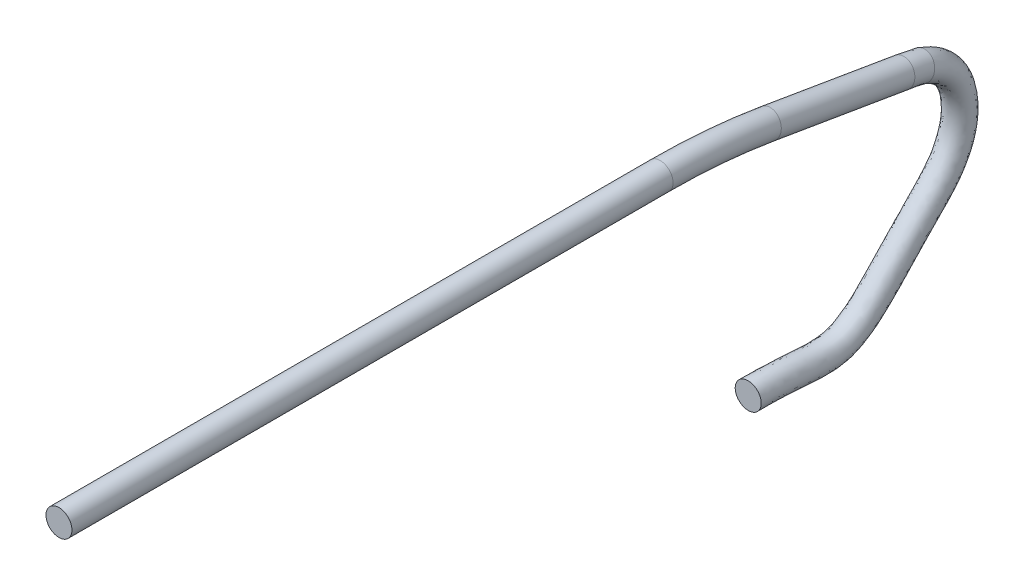
ISO-10303-21;
HEADER;
FILE_DESCRIPTION(('STEP AP214'),'2;1');
FILE_NAME('part.step','',(''),(''),'','','');
FILE_SCHEMA(('AUTOMOTIVE_DESIGN { 1 0 10303 214 1 1 1 1 }'));
ENDSEC;
DATA;
#1=APPLICATION_CONTEXT('core data for automotive mechanical design processes');
#2=APPLICATION_PROTOCOL_DEFINITION('international standard','automotive_design',2000,#1);
#3=PRODUCT_CONTEXT('',#1,'mechanical');
#4=PRODUCT('Part','Part','',(#3));
#5=PRODUCT_RELATED_PRODUCT_CATEGORY('part','',(#4));
#6=PRODUCT_DEFINITION_FORMATION('','',#4);
#7=PRODUCT_DEFINITION_CONTEXT('part definition',#1,'design');
#8=PRODUCT_DEFINITION('design','',#6,#7);
#9=PRODUCT_DEFINITION_SHAPE('','',#8);
#10=(LENGTH_UNIT() NAMED_UNIT(*) SI_UNIT(.MILLI.,.METRE.));
#11=(NAMED_UNIT(*) PLANE_ANGLE_UNIT() SI_UNIT($,.RADIAN.));
#12=(NAMED_UNIT(*) SI_UNIT($,.STERADIAN.) SOLID_ANGLE_UNIT());
#13=UNCERTAINTY_MEASURE_WITH_UNIT(LENGTH_MEASURE(1.E-05),#10,'distance_accuracy_value','');
#14=(GEOMETRIC_REPRESENTATION_CONTEXT(3) GLOBAL_UNCERTAINTY_ASSIGNED_CONTEXT((#13)) GLOBAL_UNIT_ASSIGNED_CONTEXT((#10,
#11,#12)) REPRESENTATION_CONTEXT('',''));
#15=CARTESIAN_POINT('',(0.,0.,0.));
#16=DIRECTION('',(0.,0.,1.));
#17=DIRECTION('',(1.,0.,0.));
#18=AXIS2_PLACEMENT_3D('',#15,#16,#17);
#19=CARTESIAN_POINT('',(0.,18.1941475642454,2.71925482497201));
#20=DIRECTION('',(0.,-0.166183327058587,-0.986094874648347));
#21=DIRECTION('',(0.,0.986094874648347,-0.166183327058587));
#22=AXIS2_PLACEMENT_3D('',#19,#20,#21);
#23=CYLINDRICAL_SURFACE('',#22,1.);
#24=CARTESIAN_POINT('',(0.,18.1941475642454,2.71925482497201));
#25=DIRECTION('',(0.,0.166183327058594,0.986094874648346));
#26=DIRECTION('',(1.,0.,0.));
#27=AXIS2_PLACEMENT_3D('',#24,#25,#26);
#28=CIRCLE('',#27,1.);
#29=CARTESIAN_POINT('',(0.,19.1802424388938,2.55307149791342));
#30=VERTEX_POINT('',#29);
#31=EDGE_CURVE('E10',#30,#30,#28,.T.);
#32=ORIENTED_EDGE('',*,*,#31,.F.);
#33=EDGE_LOOP('',(#32));
#34=FACE_BOUND('',#33,.T.);
#35=CARTESIAN_POINT('',(0.,16.4622432885766,-7.55747966967757));
#36=DIRECTION('',(0.,0.166183327058594,0.986094874648346));
#37=DIRECTION('',(1.,0.,0.));
#38=AXIS2_PLACEMENT_3D('',#35,#36,#37);
#39=CIRCLE('',#38,1.);
#40=CARTESIAN_POINT('',(1.,16.4622432885766,-7.55747966967757));
#41=VERTEX_POINT('',#40);
#42=EDGE_CURVE('E45',#41,#41,#39,.T.);
#43=ORIENTED_EDGE('',*,*,#42,.T.);
#44=EDGE_LOOP('',(#43));
#45=FACE_BOUND('',#44,.T.);
#46=ADVANCED_FACE('F30',(#34,#45),#23,.T.);
#47=CARTESIAN_POINT('',(0.,-31.1105961681719,11.0284211779015));
#48=DIRECTION('',(-1.,0.,0.));
#49=DIRECTION('',(0.,0.,1.));
#50=AXIS2_PLACEMENT_3D('',#47,#48,#49);
#51=TOROIDAL_SURFACE('',#50,50.,1.);
#52=CARTESIAN_POINT('',(0.,18.8894038318281,11.0284211779017));
#53=DIRECTION('',(0.,0.,1.));
#54=DIRECTION('',(1.,0.,0.));
#55=AXIS2_PLACEMENT_3D('',#52,#53,#54);
#56=CIRCLE('',#55,1.);
#57=CARTESIAN_POINT('',(0.,19.8894038318281,11.0284211779017));
#58=VERTEX_POINT('',#57);
#59=EDGE_CURVE('E36',#58,#58,#56,.T.);
#60=CARTESIAN_POINT('',(0.,-31.1105961681719,11.0284211779015));
#61=DIRECTION('',(-1.,0.,0.));
#62=DIRECTION('',(0.,0.,1.));
#63=AXIS2_PLACEMENT_3D('',#60,#61,#62);
#64=CIRCLE('',#63,51.);
#65=EDGE_CURVE('',#58,#30,#64,.T.);
#66=ORIENTED_EDGE('',*,*,#59,.F.);
#67=ORIENTED_EDGE('',*,*,#31,.T.);
#68=ORIENTED_EDGE('',*,*,#65,.T.);
#69=ORIENTED_EDGE('',*,*,#65,.F.);
#70=EDGE_LOOP('',(#66,#68,#67,#69));
#71=FACE_BOUND('',#70,.T.);
#72=ADVANCED_FACE('F77',(#71),#51,.T.);
#73=CARTESIAN_POINT('',(0.,18.8894038318281,11.0284211779017));
#74=DIRECTION('',(0.,0.,1.));
#75=DIRECTION('',(1.,0.,0.));
#76=AXIS2_PLACEMENT_3D('',#73,#74,#75);
#77=CYLINDRICAL_SURFACE('',#76,1.);
#78=ORIENTED_EDGE('',*,*,#59,.T.);
#79=EDGE_LOOP('',(#78));
#80=FACE_BOUND('',#79,.T.);
#81=CARTESIAN_POINT('',(0.,18.8894038318281,57.2770295781031));
#82=DIRECTION('',(0.,0.,1.));
#83=DIRECTION('',(1.,0.,0.));
#84=AXIS2_PLACEMENT_3D('',#81,#82,#83);
#85=CIRCLE('',#84,1.);
#86=CARTESIAN_POINT('',(1.,18.8894038318281,57.2770295781031));
#87=VERTEX_POINT('',#86);
#88=EDGE_CURVE('E40',#87,#87,#85,.T.);
#89=ORIENTED_EDGE('',*,*,#88,.F.);
#90=EDGE_LOOP('',(#89));
#91=FACE_BOUND('',#90,.T.);
#92=ADVANCED_FACE('F82',(#80,#91),#77,.T.);
#93=CARTESIAN_POINT('',(0.,18.8894038318281,57.2770295781031));
#94=DIRECTION('',(0.,0.,1.));
#95=DIRECTION('',(1.,0.,0.));
#96=AXIS2_PLACEMENT_3D('',#93,#94,#95);
#97=PLANE('',#96);
#98=ORIENTED_EDGE('',*,*,#88,.T.);
#99=EDGE_LOOP('',(#98));
#100=FACE_BOUND('',#99,.T.);
#101=ADVANCED_FACE('F73',(#100),#97,.T.);
#102=CARTESIAN_POINT('',(1.,16.4622432885766,-7.55747966967757));
#103=CARTESIAN_POINT('',(1.,16.4148155317037,-7.83890542276721));
#104=CARTESIAN_POINT('',(1.,16.3213205135418,-8.34014082138923));
#105=CARTESIAN_POINT('',(1.,16.2122653735762,-8.83815849860704));
#106=CARTESIAN_POINT('',(1.,16.1612796956823,-9.05664870644192));
#107=CARTESIAN_POINT('',(1.,18.4344330378733,-7.88984632379476));
#108=CARTESIAN_POINT('',(1.,18.3870052810004,-8.1712720768844));
#109=CARTESIAN_POINT('',(1.,18.2768862191973,-8.77382697706672));
#110=CARTESIAN_POINT('',(1.,18.1357637519508,-9.39625421122117));
#111=CARTESIAN_POINT('',(1.,18.084778074057,-9.61474441905606));
#112=CARTESIAN_POINT('',(-1.,18.4344330378733,-7.88984632379476));
#113=CARTESIAN_POINT('',(-1.,18.3870052810004,-8.1712720768844));
#114=CARTESIAN_POINT('',(-1.,18.2768862191973,-8.77382697706672));
#115=CARTESIAN_POINT('',(-1.,18.1357637519508,-9.39625421122117));
#116=CARTESIAN_POINT('',(-1.,18.084778074057,-9.61474441905606));
#117=CARTESIAN_POINT('',(-1.,16.4622432885766,-7.55747966967757));
#118=CARTESIAN_POINT('',(-1.,16.4148155317037,-7.83890542276721));
#119=CARTESIAN_POINT('',(-1.,16.3213205135418,-8.34014082138923));
#120=CARTESIAN_POINT('',(-1.,16.2122653735762,-8.83815849860704));
#121=CARTESIAN_POINT('',(-1.,16.1612796956823,-9.05664870644192));
#122=CARTESIAN_POINT('',(-1.,14.4900535392799,-7.22511301556038));
#123=CARTESIAN_POINT('',(-1.,14.442625782407,-7.50653876865002));
#124=CARTESIAN_POINT('',(-1.,14.3657548078863,-7.90645466571175));
#125=CARTESIAN_POINT('',(-1.,14.2887669952015,-8.2800627859929));
#126=CARTESIAN_POINT('',(-1.,14.2377813173077,-8.49855299382779));
#127=CARTESIAN_POINT('',(1.,14.4900535392799,-7.22511301556038));
#128=CARTESIAN_POINT('',(1.,14.442625782407,-7.50653876865002));
#129=CARTESIAN_POINT('',(1.,14.3657548078863,-7.90645466571175));
#130=CARTESIAN_POINT('',(1.,14.2887669952015,-8.2800627859929));
#131=CARTESIAN_POINT('',(1.,14.2377813173077,-8.49855299382779));
#132=CARTESIAN_POINT('',(1.,16.4622432885766,-7.55747966967757));
#133=CARTESIAN_POINT('',(1.,16.4148155317037,-7.83890542276721));
#134=CARTESIAN_POINT('',(1.,16.3213205135418,-8.34014082138923));
#135=CARTESIAN_POINT('',(1.,16.2122653735762,-8.83815849860704));
#136=CARTESIAN_POINT('',(1.,16.1612796956823,-9.05664870644192));
#137=(BOUNDED_SURFACE() B_SPLINE_SURFACE(3,3,((#102,#103,#104,#105,#106),(#107,#108,#109,#110,
#111),(#112,#113,#114,#115,#116),(#117,#118,#119,#120,#121),(#122,#123,#124,#125,#126),(#127,
#128,#129,#130,#131),(#132,#133,#134,#135,#136)),.UNSPECIFIED.,.T.,.F.,
.F.) B_SPLINE_SURFACE_WITH_KNOTS((4,3,4),(4,1,4),(0.,0.5,1.),(0.,0.559865376858509,1.),
.UNSPECIFIED.) GEOMETRIC_REPRESENTATION_ITEM() RATIONAL_B_SPLINE_SURFACE(((1.,1.,1.,1.,1.),
(0.333333333333333,0.333333333333333,0.333333333333333,0.333333333333333,0.333333333333333),
(0.333333333333333,0.333333333333333,0.333333333333333,0.333333333333333,0.333333333333333),(1.,
1.,1.,1.,1.),(0.333333333333333,0.333333333333333,0.333333333333333,0.333333333333333,
0.333333333333333),(0.333333333333333,0.333333333333333,0.333333333333333,0.333333333333333,
0.333333333333333),(1.,1.,1.,1.,1.))) REPRESENTATION_ITEM('') SURFACE());
#138=CARTESIAN_POINT('',(1.,16.1612796956823,-9.05664870644192));
#139=CARTESIAN_POINT('',(1.,18.084778074057,-9.61474441905606));
#140=CARTESIAN_POINT('',(-1.,18.084778074057,-9.61474441905606));
#141=CARTESIAN_POINT('',(-1.,16.1612796956823,-9.05664870644192));
#142=CARTESIAN_POINT('',(-1.,14.2377813173077,-8.49855299382779));
#143=CARTESIAN_POINT('',(1.,14.2377813173077,-8.49855299382779));
#144=CARTESIAN_POINT('',(1.,16.1612796956823,-9.05664870644192));
#145=(BOUNDED_CURVE() B_SPLINE_CURVE(3,(#138,#139,#140,#141,#142,#143,#144),.UNSPECIFIED.,.T.,
.F.) B_SPLINE_CURVE_WITH_KNOTS((4,3,4),(0.,0.5,1.),
.UNSPECIFIED.) CURVE() GEOMETRIC_REPRESENTATION_ITEM() RATIONAL_B_SPLINE_CURVE((1.,
0.333333333333333,0.333333333333333,1.,0.333333333333333,0.333333333333333,1.)) REPRESENTATION_ITEM(''));
#146=CARTESIAN_POINT('',(1.,16.1612796956823,-9.05664870644192));
#147=VERTEX_POINT('',#146);
#148=EDGE_CURVE('E49',#147,#147,#145,.F.);
#149=ORIENTED_EDGE('',*,*,#42,.F.);
#150=EDGE_LOOP('',(#149));
#151=FACE_BOUND('',#150,.T.);
#152=ORIENTED_EDGE('',*,*,#148,.F.);
#153=EDGE_LOOP('',(#152));
#154=FACE_BOUND('',#153,.T.);
#155=ADVANCED_FACE('F65',(#151,#154),#137,.F.);
#156=CARTESIAN_POINT('',(-1.,0.830941557178572,4.25));
#157=DIRECTION('',(0.,0.00883124278007635,-0.999961003815128));
#158=DIRECTION('',(0.,0.999961003815128,0.00883124278007635));
#159=AXIS2_PLACEMENT_3D('',#156,#157,#158);
#160=PLANE('',#159);
#161=CARTESIAN_POINT('',(0.,0.830941557178572,4.25));
#162=DIRECTION('',(0.,0.00883124278007635,-0.999961003815129));
#163=DIRECTION('',(0.,0.999961003815129,0.00883124278007635));
#164=AXIS2_PLACEMENT_3D('',#161,#162,#163);
#165=CIRCLE('',#164,1.);
#166=CARTESIAN_POINT('',(0.,1.8309025609937,4.25883124278008));
#167=VERTEX_POINT('',#166);
#168=EDGE_CURVE('E54',#167,#167,#165,.T.);
#169=ORIENTED_EDGE('',*,*,#168,.F.);
#170=EDGE_LOOP('',(#169));
#171=FACE_BOUND('',#170,.T.);
#172=ADVANCED_FACE('F63',(#171),#160,.F.);
#173=CARTESIAN_POINT('',(1.,16.1612796956823,-9.05664870644192));
#174=CARTESIAN_POINT('',(1.,16.0630076664788,-9.33845795923568));
#175=CARTESIAN_POINT('',(1.,15.8257037242961,-9.87581699205051));
#176=CARTESIAN_POINT('',(1.,15.3331270189899,-10.5903974674787));
#177=CARTESIAN_POINT('',(1.,14.7153514278387,-11.1759648938384));
#178=CARTESIAN_POINT('',(1.,13.8994226840394,-11.6556417468679));
#179=CARTESIAN_POINT('',(1.,12.8912901418336,-11.9671882675556));
#180=CARTESIAN_POINT('',(1.,11.7425811914177,-12.0551001131256));
#181=CARTESIAN_POINT('',(1.,10.1490442261889,-11.8496627922521));
#182=CARTESIAN_POINT('',(1.,8.25725857251028,-10.8580244738748));
#183=CARTESIAN_POINT('',(1.,6.47139378970423,-9.03337521159973));
#184=CARTESIAN_POINT('',(1.,4.60749481913339,-7.26501633891204));
#185=CARTESIAN_POINT('',(1.,2.56604468232702,-5.3618196437168));
#186=CARTESIAN_POINT('',(1.,0.358988403048485,-2.86167264155835));
#187=CARTESIAN_POINT('',(1.,0.761837943264512,0.783731527148287));
#188=CARTESIAN_POINT('',(1.,0.841364430054749,3.0698188314546));
#189=CARTESIAN_POINT('',(1.,0.830941557178572,4.25));
#190=CARTESIAN_POINT('',(1.,14.2377813173077,-8.49855299382779));
#191=CARTESIAN_POINT('',(1.,14.1395092881042,-8.78036224662154));
#192=CARTESIAN_POINT('',(1.,14.0292407275379,-8.94462474326745));
#193=CARTESIAN_POINT('',(1.,13.7326047522238,-9.36962251148596));
#194=CARTESIAN_POINT('',(1.,13.4345276306917,-9.61174210599729));
#195=CARTESIAN_POINT('',(1.,13.0448519779285,-9.82500995893211));
#196=CARTESIAN_POINT('',(1.,12.4521659578175,-9.99786803989055));
#197=CARTESIAN_POINT('',(1.,11.7389937912091,-10.0396463164391));
#198=CARTESIAN_POINT('',(1.,10.7335036253861,-9.89143490335701));
#199=CARTESIAN_POINT('',(1.,9.53009501944245,-9.26856898099143));
#200=CARTESIAN_POINT('',(1.,7.92879827480215,-7.66506170555224));
#201=CARTESIAN_POINT('',(1.,5.85338117333515,-5.70539364796868));
#202=CARTESIAN_POINT('',(1.,4.02002082520793,-3.92548654931856));
#203=CARTESIAN_POINT('',(1.,2.41749126696577,-2.42220545203905));
#204=CARTESIAN_POINT('',(1.,2.74241996237963,0.52469819651461));
#205=CARTESIAN_POINT('',(1.,2.84128643768501,3.08748131701476));
#206=CARTESIAN_POINT('',(1.,2.83086356480883,4.26766248556016));
#207=CARTESIAN_POINT('',(-1.,14.2377813173077,-8.49855299382779));
#208=CARTESIAN_POINT('',(-1.,14.1395092881042,-8.78036224662154));
#209=CARTESIAN_POINT('',(-1.,14.0292407275379,-8.94462474326745));
#210=CARTESIAN_POINT('',(-1.,13.7326047522238,-9.36962251148596));
#211=CARTESIAN_POINT('',(-1.,13.4345276306917,-9.61174210599729));
#212=CARTESIAN_POINT('',(-1.,13.0448519779285,-9.82500995893211));
#213=CARTESIAN_POINT('',(-1.,12.4521659578175,-9.99786803989055));
#214=CARTESIAN_POINT('',(-1.,11.7389937912091,-10.0396463164391));
#215=CARTESIAN_POINT('',(-1.,10.7335036253861,-9.89143490335701));
#216=CARTESIAN_POINT('',(-1.,9.53009501944245,-9.26856898099143));
#217=CARTESIAN_POINT('',(-1.,7.92879827480215,-7.66506170555224));
#218=CARTESIAN_POINT('',(-1.,5.85338117333515,-5.70539364796868));
#219=CARTESIAN_POINT('',(-1.,4.02002082520793,-3.92548654931856));
#220=CARTESIAN_POINT('',(-1.,2.41749126696577,-2.42220545203905));
#221=CARTESIAN_POINT('',(-1.,2.74241996237963,0.52469819651461));
#222=CARTESIAN_POINT('',(-1.,2.84128643768501,3.08748131701476));
#223=CARTESIAN_POINT('',(-1.,2.83086356480883,4.26766248556016));
#224=CARTESIAN_POINT('',(-1.,16.1612796956823,-9.05664870644192));
#225=CARTESIAN_POINT('',(-1.,16.0630076664788,-9.33845795923567));
#226=CARTESIAN_POINT('',(-1.,15.8257037242961,-9.87581699205051));
#227=CARTESIAN_POINT('',(-1.,15.3331270189899,-10.5903974674787));
#228=CARTESIAN_POINT('',(-1.,14.7153514278387,-11.1759648938384));
#229=CARTESIAN_POINT('',(-1.,13.8994226840394,-11.6556417468679));
#230=CARTESIAN_POINT('',(-1.,12.8912901418336,-11.9671882675556));
#231=CARTESIAN_POINT('',(-1.,11.7425811914177,-12.0551001131256));
#232=CARTESIAN_POINT('',(-1.,10.1490442261889,-11.8496627922521));
#233=CARTESIAN_POINT('',(-1.,8.25725857251028,-10.8580244738748));
#234=CARTESIAN_POINT('',(-1.,6.47139378970423,-9.03337521159973));
#235=CARTESIAN_POINT('',(-1.,4.60749481913339,-7.26501633891204));
#236=CARTESIAN_POINT('',(-1.,2.56604468232702,-5.3618196437168));
#237=CARTESIAN_POINT('',(-1.,0.358988403048485,-2.86167264155835));
#238=CARTESIAN_POINT('',(-1.,0.761837943264512,0.783731527148287));
#239=CARTESIAN_POINT('',(-1.,0.841364430054749,3.0698188314546));
#240=CARTESIAN_POINT('',(-1.,0.830941557178572,4.25));
#241=CARTESIAN_POINT('',(-1.,18.0847780740569,-9.61474441905606));
#242=CARTESIAN_POINT('',(-1.,17.9865060448534,-9.8965536718498));
#243=CARTESIAN_POINT('',(-1.,17.6221667210542,-10.8070092408336));
#244=CARTESIAN_POINT('',(-1.,16.933649285756,-11.8111724234715));
#245=CARTESIAN_POINT('',(-0.999999999999999,15.9961752249857,-12.7401876816794));
#246=CARTESIAN_POINT('',(-1.,14.7539933901503,-13.4862735348036));
#247=CARTESIAN_POINT('',(-1.,13.3304143258496,-13.9365084952207));
#248=CARTESIAN_POINT('',(-1.,11.7461685916263,-14.070553909812));
#249=CARTESIAN_POINT('',(-1.,9.56458482699164,-13.8078906811471));
#250=CARTESIAN_POINT('',(-1.,6.98442212557812,-12.4474799667582));
#251=CARTESIAN_POINT('',(-1.,5.01398930460631,-10.4016887176472));
#252=CARTESIAN_POINT('',(-1.,3.36160846493163,-8.82463902985539));
#253=CARTESIAN_POINT('',(-1.,1.11206853944612,-6.79815273811502));
#254=CARTESIAN_POINT('',(-1.,-1.69951446086878,-3.30113983107765));
#255=CARTESIAN_POINT('',(-1.,-1.21874407585058,1.04276485778196));
#256=CARTESIAN_POINT('',(-1.,-1.1585575775755,3.05215634589445));
#257=CARTESIAN_POINT('',(-1.,-1.16898045045167,4.23233751443985));
#258=CARTESIAN_POINT('',(1.,18.0847780740569,-9.61474441905606));
#259=CARTESIAN_POINT('',(1.,17.9865060448534,-9.8965536718498));
#260=CARTESIAN_POINT('',(1.,17.6221667210542,-10.8070092408336));
#261=CARTESIAN_POINT('',(1.,16.933649285756,-11.8111724234715));
#262=CARTESIAN_POINT('',(1.,15.9961752249857,-12.7401876816794));
#263=CARTESIAN_POINT('',(1.,14.7539933901503,-13.4862735348036));
#264=CARTESIAN_POINT('',(1.,13.3304143258496,-13.9365084952207));
#265=CARTESIAN_POINT('',(1.,11.7461685916263,-14.070553909812));
#266=CARTESIAN_POINT('',(1.,9.56458482699164,-13.8078906811471));
#267=CARTESIAN_POINT('',(1.,6.98442212557812,-12.4474799667582));
#268=CARTESIAN_POINT('',(1.,5.01398930460631,-10.4016887176472));
#269=CARTESIAN_POINT('',(1.,3.36160846493163,-8.82463902985539));
#270=CARTESIAN_POINT('',(1.,1.11206853944612,-6.79815273811502));
#271=CARTESIAN_POINT('',(1.,-1.69951446086878,-3.30113983107765));
#272=CARTESIAN_POINT('',(1.,-1.21874407585058,1.04276485778196));
#273=CARTESIAN_POINT('',(1.,-1.1585575775755,3.05215634589445));
#274=CARTESIAN_POINT('',(1.,-1.16898045045167,4.23233751443985));
#275=CARTESIAN_POINT('',(1.,16.1612796956823,-9.05664870644192));
#276=CARTESIAN_POINT('',(1.,16.0630076664788,-9.33845795923568));
#277=CARTESIAN_POINT('',(1.,15.8257037242961,-9.87581699205051));
#278=CARTESIAN_POINT('',(1.,15.3331270189899,-10.5903974674787));
#279=CARTESIAN_POINT('',(1.,14.7153514278387,-11.1759648938384));
#280=CARTESIAN_POINT('',(1.,13.8994226840394,-11.6556417468679));
#281=CARTESIAN_POINT('',(1.,12.8912901418336,-11.9671882675556));
#282=CARTESIAN_POINT('',(1.,11.7425811914177,-12.0551001131256));
#283=CARTESIAN_POINT('',(1.,10.1490442261889,-11.8496627922521));
#284=CARTESIAN_POINT('',(1.,8.25725857251028,-10.8580244738748));
#285=CARTESIAN_POINT('',(1.,6.47139378970423,-9.03337521159973));
#286=CARTESIAN_POINT('',(1.,4.60749481913339,-7.26501633891204));
#287=CARTESIAN_POINT('',(1.,2.56604468232702,-5.3618196437168));
#288=CARTESIAN_POINT('',(1.,0.358988403048485,-2.86167264155835));
#289=CARTESIAN_POINT('',(1.,0.761837943264512,0.783731527148287));
#290=CARTESIAN_POINT('',(1.,0.841364430054749,3.0698188314546));
#291=CARTESIAN_POINT('',(1.,0.830941557178572,4.25));
#292=(BOUNDED_SURFACE() B_SPLINE_SURFACE(3,3,((#173,#174,#175,#176,#177,#178,#179,#180,#181,
#182,#183,#184,#185,#186,#187,#188,#189),(#190,#191,#192,#193,#194,#195,#196,#197,#198,#199,
#200,#201,#202,#203,#204,#205,#206),(#207,#208,#209,#210,#211,#212,#213,#214,#215,#216,#217,
#218,#219,#220,#221,#222,#223),(#224,#225,#226,#227,#228,#229,#230,#231,#232,#233,#234,#235,
#236,#237,#238,#239,#240),(#241,#242,#243,#244,#245,#246,#247,#248,#249,#250,#251,#252,#253,
#254,#255,#256,#257),(#258,#259,#260,#261,#262,#263,#264,#265,#266,#267,#268,#269,#270,#271,
#272,#273,#274),(#275,#276,#277,#278,#279,#280,#281,#282,#283,#284,#285,#286,#287,#288,#289,
#290,#291)),.UNSPECIFIED.,.T.,.F.,.F.) B_SPLINE_SURFACE_WITH_KNOTS((4,3,4),(4,1,1,1,1,1,1,1,1,1,
1,1,1,1,4),(0.,0.5,1.),(0.,0.0326668180039569,0.0639073085866412,0.0944122836213563,
0.125065964009353,0.16672858392261,0.208714014648681,0.250271282986036,0.341239181181987,
0.435035744445737,0.529409137987888,0.6214398918182,0.744866978992243,0.87083549440452,1.),
.UNSPECIFIED.) GEOMETRIC_REPRESENTATION_ITEM() RATIONAL_B_SPLINE_SURFACE(((1.,1.,1.,1.,1.,1.,1.,
1.,1.,1.,1.,1.,1.,1.,1.,1.,1.),(0.333333333333333,0.333333333333333,0.333333333333333,
0.333333333333333,0.333333333333333,0.333333333333333,0.333333333333333,0.333333333333333,
0.333333333333333,0.333333333333333,0.333333333333333,0.333333333333333,0.333333333333333,
0.333333333333333,0.333333333333333,0.333333333333333,0.333333333333333),(0.333333333333333,
0.333333333333333,0.333333333333333,0.333333333333333,0.333333333333333,0.333333333333333,
0.333333333333333,0.333333333333333,0.333333333333333,0.333333333333333,0.333333333333333,
0.333333333333333,0.333333333333333,0.333333333333333,0.333333333333333,0.333333333333333,
0.333333333333333),(1.,1.,1.,1.,1.,1.,1.,1.,1.,1.,1.,1.,1.,1.,1.,1.,1.),(0.333333333333333,
0.333333333333333,0.333333333333333,0.333333333333333,0.333333333333333,0.333333333333333,
0.333333333333333,0.333333333333333,0.333333333333333,0.333333333333333,0.333333333333333,
0.333333333333333,0.333333333333333,0.333333333333333,0.333333333333333,0.333333333333333,
0.333333333333333),(0.333333333333333,0.333333333333333,0.333333333333333,0.333333333333333,
0.333333333333333,0.333333333333333,0.333333333333333,0.333333333333333,0.333333333333333,
0.333333333333333,0.333333333333333,0.333333333333333,0.333333333333333,0.333333333333333,
0.333333333333333,0.333333333333333,0.333333333333333),(1.,1.,1.,1.,1.,1.,1.,1.,1.,1.,1.,1.,1.,
1.,1.,1.,1.))) REPRESENTATION_ITEM('') SURFACE());
#293=ORIENTED_EDGE('',*,*,#148,.T.);
#294=EDGE_LOOP('',(#293));
#295=FACE_BOUND('',#294,.T.);
#296=ORIENTED_EDGE('',*,*,#168,.T.);
#297=EDGE_LOOP('',(#296));
#298=FACE_BOUND('',#297,.T.);
#299=ADVANCED_FACE('F61',(#295,#298),#292,.T.);
#300=CLOSED_SHELL('',(#46,#72,#92,#101,#155,#172,#299));
#301=MANIFOLD_SOLID_BREP('B2',#300);
#302=ADVANCED_BREP_SHAPE_REPRESENTATION('',(#18,#301),#14);
#303=SHAPE_DEFINITION_REPRESENTATION(#9,#302);
ENDSEC;
END-ISO-10303-21;
